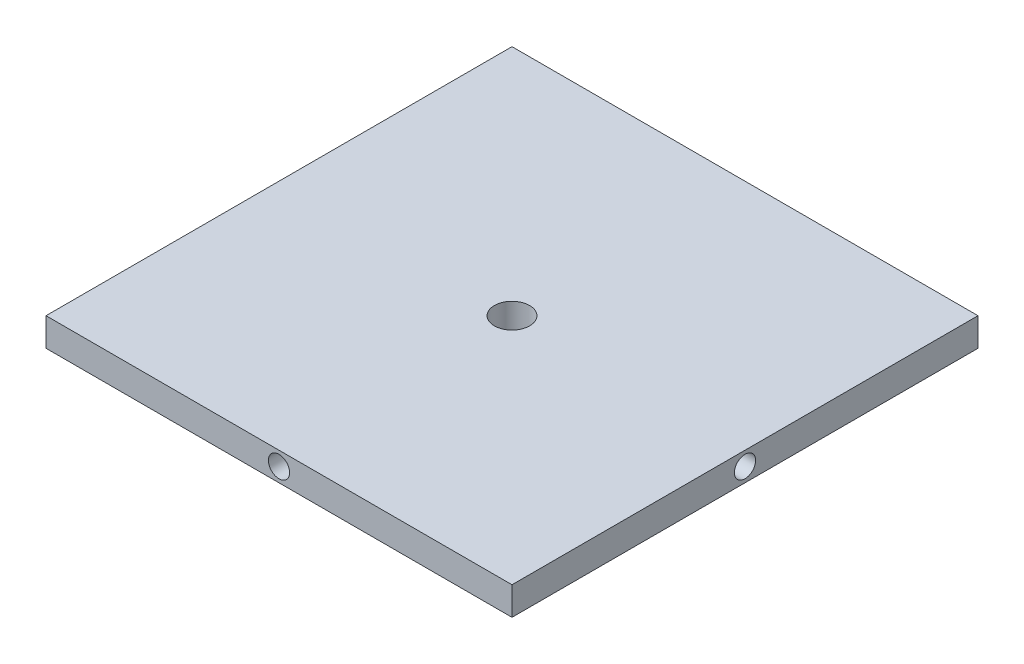
ISO-10303-21;
HEADER;
FILE_DESCRIPTION(('STEP AP214'),'2;1');
FILE_NAME('part.step','',(''),(''),'','','');
FILE_SCHEMA(('AUTOMOTIVE_DESIGN { 1 0 10303 214 1 1 1 1 }'));
ENDSEC;
DATA;
#1=APPLICATION_CONTEXT('core data for automotive mechanical design processes');
#2=APPLICATION_PROTOCOL_DEFINITION('international standard','automotive_design',2000,#1);
#3=PRODUCT_CONTEXT('',#1,'mechanical');
#4=PRODUCT('Part','Part','',(#3));
#5=PRODUCT_RELATED_PRODUCT_CATEGORY('part','',(#4));
#6=PRODUCT_DEFINITION_FORMATION('','',#4);
#7=PRODUCT_DEFINITION_CONTEXT('part definition',#1,'design');
#8=PRODUCT_DEFINITION('design','',#6,#7);
#9=PRODUCT_DEFINITION_SHAPE('','',#8);
#10=(LENGTH_UNIT() NAMED_UNIT(*) SI_UNIT(.MILLI.,.METRE.));
#11=(NAMED_UNIT(*) PLANE_ANGLE_UNIT() SI_UNIT($,.RADIAN.));
#12=(NAMED_UNIT(*) SI_UNIT($,.STERADIAN.) SOLID_ANGLE_UNIT());
#13=UNCERTAINTY_MEASURE_WITH_UNIT(LENGTH_MEASURE(1.E-05),#10,'distance_accuracy_value','');
#14=(GEOMETRIC_REPRESENTATION_CONTEXT(3) GLOBAL_UNCERTAINTY_ASSIGNED_CONTEXT((#13)) GLOBAL_UNIT_ASSIGNED_CONTEXT((#10,
#11,#12)) REPRESENTATION_CONTEXT('',''));
#15=CARTESIAN_POINT('',(0.,0.,0.));
#16=DIRECTION('',(0.,0.,1.));
#17=DIRECTION('',(1.,0.,0.));
#18=AXIS2_PLACEMENT_3D('',#15,#16,#17);
#19=CARTESIAN_POINT('',(0.,25.4,0.));
#20=DIRECTION('',(0.,-1.,0.));
#21=DIRECTION('',(0.,0.,-1.));
#22=AXIS2_PLACEMENT_3D('',#19,#20,#21);
#23=PLANE('',#22);
#24=DIRECTION('',(0.,0.,-1.));
#25=VECTOR('',#24,1.);
#26=CARTESIAN_POINT('',(209.55,25.4,209.55));
#27=LINE('',#26,#25);
#28=CARTESIAN_POINT('',(209.55,25.4,209.55));
#29=VERTEX_POINT('',#28);
#30=CARTESIAN_POINT('',(209.55,25.4,-209.55));
#31=VERTEX_POINT('',#30);
#32=EDGE_CURVE('E116',#29,#31,#27,.T.);
#33=ORIENTED_EDGE('',*,*,#32,.T.);
#34=DIRECTION('',(-1.,0.,0.));
#35=VECTOR('',#34,1.);
#36=CARTESIAN_POINT('',(-209.55,25.4,-209.55));
#37=LINE('',#36,#35);
#38=CARTESIAN_POINT('',(-209.55,25.4,-209.55));
#39=VERTEX_POINT('',#38);
#40=EDGE_CURVE('E81',#31,#39,#37,.T.);
#41=ORIENTED_EDGE('',*,*,#40,.T.);
#42=DIRECTION('',(0.,0.,1.));
#43=VECTOR('',#42,1.);
#44=CARTESIAN_POINT('',(-209.55,25.4,209.55));
#45=LINE('',#44,#43);
#46=CARTESIAN_POINT('',(-209.55,25.4,209.55));
#47=VERTEX_POINT('',#46);
#48=EDGE_CURVE('E119',#39,#47,#45,.T.);
#49=ORIENTED_EDGE('',*,*,#48,.T.);
#50=DIRECTION('',(1.,0.,0.));
#51=VECTOR('',#50,1.);
#52=CARTESIAN_POINT('',(-209.55,25.4,209.55));
#53=LINE('',#52,#51);
#54=EDGE_CURVE('E50',#47,#29,#53,.T.);
#55=ORIENTED_EDGE('',*,*,#54,.T.);
#56=EDGE_LOOP('',(#33,#41,#49,#55));
#57=FACE_BOUND('',#56,.T.);
#58=CARTESIAN_POINT('',(0.,25.4,0.));
#59=DIRECTION('',(0.,1.,0.));
#60=DIRECTION('',(0.,0.,1.));
#61=AXIS2_PLACEMENT_3D('',#58,#59,#60);
#62=CIRCLE('',#61,15.875);
#63=CARTESIAN_POINT('',(0.,25.4,15.875));
#64=VERTEX_POINT('',#63);
#65=EDGE_CURVE('E110',#64,#64,#62,.T.);
#66=ORIENTED_EDGE('',*,*,#65,.F.);
#67=EDGE_LOOP('',(#66));
#68=FACE_BOUND('',#67,.T.);
#69=ADVANCED_FACE('F33',(#57,#68),#23,.F.);
#70=CARTESIAN_POINT('',(0.,0.,0.));
#71=DIRECTION('',(0.,-1.,0.));
#72=DIRECTION('',(0.,0.,-1.));
#73=AXIS2_PLACEMENT_3D('',#70,#71,#72);
#74=PLANE('',#73);
#75=DIRECTION('',(0.,0.,-1.));
#76=VECTOR('',#75,1.);
#77=CARTESIAN_POINT('',(209.55,0.,209.55));
#78=LINE('',#77,#76);
#79=CARTESIAN_POINT('',(209.55,0.,209.55));
#80=VERTEX_POINT('',#79);
#81=CARTESIAN_POINT('',(209.55,0.,-209.55));
#82=VERTEX_POINT('',#81);
#83=EDGE_CURVE('E113',#80,#82,#78,.T.);
#84=ORIENTED_EDGE('',*,*,#83,.F.);
#85=DIRECTION('',(1.,0.,0.));
#86=VECTOR('',#85,1.);
#87=CARTESIAN_POINT('',(-209.55,0.,209.55));
#88=LINE('',#87,#86);
#89=CARTESIAN_POINT('',(-209.55,0.,209.55));
#90=VERTEX_POINT('',#89);
#91=EDGE_CURVE('E74',#90,#80,#88,.T.);
#92=ORIENTED_EDGE('',*,*,#91,.F.);
#93=DIRECTION('',(0.,0.,1.));
#94=VECTOR('',#93,1.);
#95=CARTESIAN_POINT('',(-209.55,0.,209.55));
#96=LINE('',#95,#94);
#97=CARTESIAN_POINT('',(-209.55,0.,-209.55));
#98=VERTEX_POINT('',#97);
#99=EDGE_CURVE('E68',#98,#90,#96,.T.);
#100=ORIENTED_EDGE('',*,*,#99,.F.);
#101=DIRECTION('',(-1.,0.,0.));
#102=VECTOR('',#101,1.);
#103=CARTESIAN_POINT('',(-209.55,0.,-209.55));
#104=LINE('',#103,#102);
#105=EDGE_CURVE('E125',#82,#98,#104,.T.);
#106=ORIENTED_EDGE('',*,*,#105,.F.);
#107=EDGE_LOOP('',(#84,#92,#100,#106));
#108=FACE_BOUND('',#107,.T.);
#109=CARTESIAN_POINT('',(0.,0.,0.));
#110=DIRECTION('',(0.,1.,0.));
#111=DIRECTION('',(0.,0.,1.));
#112=AXIS2_PLACEMENT_3D('',#109,#110,#111);
#113=CIRCLE('',#112,15.875);
#114=CARTESIAN_POINT('',(0.,0.,15.875));
#115=VERTEX_POINT('',#114);
#116=EDGE_CURVE('E109',#115,#115,#113,.T.);
#117=ORIENTED_EDGE('',*,*,#116,.T.);
#118=EDGE_LOOP('',(#117));
#119=FACE_BOUND('',#118,.T.);
#120=ADVANCED_FACE('F135',(#108,#119),#74,.T.);
#121=CARTESIAN_POINT('',(209.55,25.4,209.55));
#122=DIRECTION('',(-1.,0.,0.));
#123=DIRECTION('',(0.,0.,1.));
#124=AXIS2_PLACEMENT_3D('',#121,#122,#123);
#125=PLANE('',#124);
#126=CARTESIAN_POINT('',(209.55,12.7,0.));
#127=DIRECTION('',(1.,0.,0.));
#128=DIRECTION('',(0.,0.,-1.));
#129=AXIS2_PLACEMENT_3D('',#126,#127,#128);
#130=CIRCLE('',#129,9.52499999999999);
#131=CARTESIAN_POINT('',(209.55,12.7,-9.52499999999999));
#132=VERTEX_POINT('',#131);
#133=EDGE_CURVE('E98',#132,#132,#130,.T.);
#134=ORIENTED_EDGE('',*,*,#133,.F.);
#135=EDGE_LOOP('',(#134));
#136=FACE_BOUND('',#135,.T.);
#137=ORIENTED_EDGE('',*,*,#83,.T.);
#138=DIRECTION('',(0.,-1.,0.));
#139=VECTOR('',#138,1.);
#140=CARTESIAN_POINT('',(209.55,25.4,-209.55));
#141=LINE('',#140,#139);
#142=EDGE_CURVE('E11',#31,#82,#141,.T.);
#143=ORIENTED_EDGE('',*,*,#142,.F.);
#144=ORIENTED_EDGE('',*,*,#32,.F.);
#145=DIRECTION('',(0.,-1.,0.));
#146=VECTOR('',#145,1.);
#147=CARTESIAN_POINT('',(209.55,25.4,209.55));
#148=LINE('',#147,#146);
#149=EDGE_CURVE('E122',#29,#80,#148,.T.);
#150=ORIENTED_EDGE('',*,*,#149,.T.);
#151=EDGE_LOOP('',(#137,#143,#144,#150));
#152=FACE_BOUND('',#151,.T.);
#153=ADVANCED_FACE('F35',(#136,#152),#125,.F.);
#154=CARTESIAN_POINT('',(-209.55,25.4,-209.55));
#155=DIRECTION('',(0.,0.,1.));
#156=DIRECTION('',(1.,0.,0.));
#157=AXIS2_PLACEMENT_3D('',#154,#155,#156);
#158=PLANE('',#157);
#159=ORIENTED_EDGE('',*,*,#105,.T.);
#160=DIRECTION('',(0.,-1.,0.));
#161=VECTOR('',#160,1.);
#162=CARTESIAN_POINT('',(-209.55,25.4,-209.55));
#163=LINE('',#162,#161);
#164=EDGE_CURVE('E42',#39,#98,#163,.T.);
#165=ORIENTED_EDGE('',*,*,#164,.F.);
#166=ORIENTED_EDGE('',*,*,#40,.F.);
#167=ORIENTED_EDGE('',*,*,#142,.T.);
#168=EDGE_LOOP('',(#159,#165,#166,#167));
#169=FACE_BOUND('',#168,.T.);
#170=ADVANCED_FACE('F152',(#169),#158,.F.);
#171=CARTESIAN_POINT('',(-209.55,25.4,209.55));
#172=DIRECTION('',(1.,0.,0.));
#173=DIRECTION('',(0.,0.,-1.));
#174=AXIS2_PLACEMENT_3D('',#171,#172,#173);
#175=PLANE('',#174);
#176=ORIENTED_EDGE('',*,*,#99,.T.);
#177=DIRECTION('',(0.,-1.,0.));
#178=VECTOR('',#177,1.);
#179=CARTESIAN_POINT('',(-209.55,25.4,209.55));
#180=LINE('',#179,#178);
#181=EDGE_CURVE('E130',#47,#90,#180,.T.);
#182=ORIENTED_EDGE('',*,*,#181,.F.);
#183=ORIENTED_EDGE('',*,*,#48,.F.);
#184=ORIENTED_EDGE('',*,*,#164,.T.);
#185=EDGE_LOOP('',(#176,#182,#183,#184));
#186=FACE_BOUND('',#185,.T.);
#187=ADVANCED_FACE('F132',(#186),#175,.F.);
#188=CARTESIAN_POINT('',(-209.55,25.4,209.55));
#189=DIRECTION('',(0.,0.,-1.));
#190=DIRECTION('',(-1.,0.,0.));
#191=AXIS2_PLACEMENT_3D('',#188,#189,#190);
#192=PLANE('',#191);
#193=CARTESIAN_POINT('',(0.,12.7,209.55));
#194=DIRECTION('',(0.,0.,1.));
#195=DIRECTION('',(1.,0.,0.));
#196=AXIS2_PLACEMENT_3D('',#193,#194,#195);
#197=CIRCLE('',#196,9.52499999999998);
#198=CARTESIAN_POINT('',(9.52499999999998,12.7,209.55));
#199=VERTEX_POINT('',#198);
#200=EDGE_CURVE('E99',#199,#199,#197,.T.);
#201=ORIENTED_EDGE('',*,*,#200,.F.);
#202=EDGE_LOOP('',(#201));
#203=FACE_BOUND('',#202,.T.);
#204=ORIENTED_EDGE('',*,*,#91,.T.);
#205=ORIENTED_EDGE('',*,*,#149,.F.);
#206=ORIENTED_EDGE('',*,*,#54,.F.);
#207=ORIENTED_EDGE('',*,*,#181,.T.);
#208=EDGE_LOOP('',(#204,#205,#206,#207));
#209=FACE_BOUND('',#208,.T.);
#210=ADVANCED_FACE('F140',(#203,#209),#192,.F.);
#211=CARTESIAN_POINT('',(0.,25.4,0.));
#212=DIRECTION('',(0.,-1.,0.));
#213=DIRECTION('',(0.,0.,-1.));
#214=AXIS2_PLACEMENT_3D('',#211,#212,#213);
#215=CYLINDRICAL_SURFACE('',#214,15.875);
#216=ORIENTED_EDGE('',*,*,#65,.T.);
#217=EDGE_LOOP('',(#216));
#218=FACE_BOUND('',#217,.T.);
#219=ORIENTED_EDGE('',*,*,#116,.F.);
#220=EDGE_LOOP('',(#219));
#221=FACE_BOUND('',#220,.T.);
#222=ADVANCED_FACE('F142',(#218,#221),#215,.F.);
#223=CARTESIAN_POINT('',(133.35,12.7,0.));
#224=DIRECTION('',(1.,0.,0.));
#225=DIRECTION('',(0.,0.,-1.));
#226=AXIS2_PLACEMENT_3D('',#223,#224,#225);
#227=CONICAL_SURFACE('',#226,9.52499999999997,1.02974425867665);
#228=CARTESIAN_POINT('',(127.626802603763,12.7,0.));
#229=VERTEX_POINT('',#228);
#230=VERTEX_LOOP('',#229);
#231=FACE_BOUND('',#230,.T.);
#232=CARTESIAN_POINT('',(133.35,12.7,0.));
#233=DIRECTION('',(1.,0.,0.));
#234=DIRECTION('',(0.,0.,-1.));
#235=AXIS2_PLACEMENT_3D('',#232,#233,#234);
#236=CIRCLE('',#235,9.52499999999997);
#237=CARTESIAN_POINT('',(133.35,12.7,-9.52499999999997));
#238=VERTEX_POINT('',#237);
#239=EDGE_CURVE('E102',#238,#238,#236,.T.);
#240=ORIENTED_EDGE('',*,*,#239,.T.);
#241=EDGE_LOOP('',(#240));
#242=FACE_BOUND('',#241,.T.);
#243=ADVANCED_FACE('F149',(#231,#242),#227,.F.);
#244=CARTESIAN_POINT('',(209.55,12.7,0.));
#245=DIRECTION('',(1.,0.,0.));
#246=DIRECTION('',(0.,0.,-1.));
#247=AXIS2_PLACEMENT_3D('',#244,#245,#246);
#248=CYLINDRICAL_SURFACE('',#247,9.52499999999998);
#249=ORIENTED_EDGE('',*,*,#239,.F.);
#250=EDGE_LOOP('',(#249));
#251=FACE_BOUND('',#250,.T.);
#252=ORIENTED_EDGE('',*,*,#133,.T.);
#253=EDGE_LOOP('',(#252));
#254=FACE_BOUND('',#253,.T.);
#255=ADVANCED_FACE('F92',(#251,#254),#248,.F.);
#256=CARTESIAN_POINT('',(0.,12.7,133.35));
#257=DIRECTION('',(0.,0.,1.));
#258=DIRECTION('',(1.,0.,0.));
#259=AXIS2_PLACEMENT_3D('',#256,#257,#258);
#260=CONICAL_SURFACE('',#259,9.52499999999997,1.02974425867665);
#261=CARTESIAN_POINT('',(0.,12.7,127.626802603762));
#262=VERTEX_POINT('',#261);
#263=VERTEX_LOOP('',#262);
#264=FACE_BOUND('',#263,.T.);
#265=CARTESIAN_POINT('',(0.,12.7,133.35));
#266=DIRECTION('',(0.,0.,1.));
#267=DIRECTION('',(1.,0.,0.));
#268=AXIS2_PLACEMENT_3D('',#265,#266,#267);
#269=CIRCLE('',#268,9.52499999999997);
#270=CARTESIAN_POINT('',(9.52499999999997,12.7,133.35));
#271=VERTEX_POINT('',#270);
#272=EDGE_CURVE('E96',#271,#271,#269,.T.);
#273=ORIENTED_EDGE('',*,*,#272,.T.);
#274=EDGE_LOOP('',(#273));
#275=FACE_BOUND('',#274,.T.);
#276=ADVANCED_FACE('F88',(#264,#275),#260,.F.);
#277=CARTESIAN_POINT('',(0.,12.7,209.55));
#278=DIRECTION('',(0.,0.,1.));
#279=DIRECTION('',(1.,0.,0.));
#280=AXIS2_PLACEMENT_3D('',#277,#278,#279);
#281=CYLINDRICAL_SURFACE('',#280,9.52499999999997);
#282=ORIENTED_EDGE('',*,*,#272,.F.);
#283=EDGE_LOOP('',(#282));
#284=FACE_BOUND('',#283,.T.);
#285=ORIENTED_EDGE('',*,*,#200,.T.);
#286=EDGE_LOOP('',(#285));
#287=FACE_BOUND('',#286,.T.);
#288=ADVANCED_FACE('F91',(#284,#287),#281,.F.);
#289=CLOSED_SHELL('',(#69,#120,#153,#170,#187,#210,#222,#243,#255,#276,#288));
#290=MANIFOLD_SOLID_BREP('B2',#289);
#291=ADVANCED_BREP_SHAPE_REPRESENTATION('',(#18,#290),#14);
#292=SHAPE_DEFINITION_REPRESENTATION(#9,#291);
ENDSEC;
END-ISO-10303-21;
